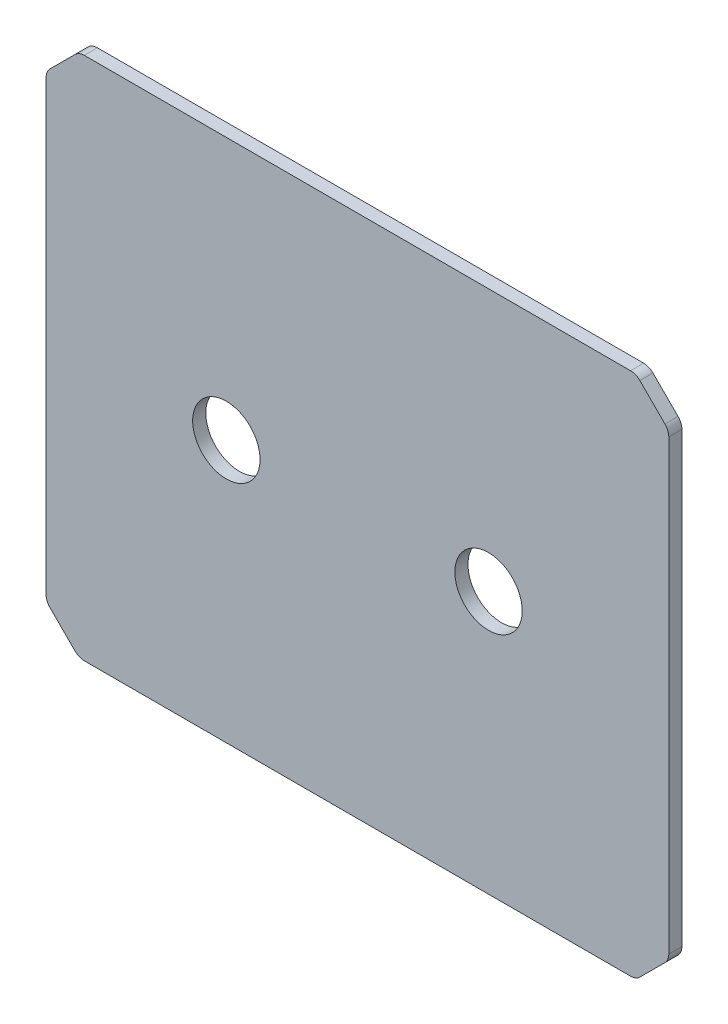
ISO-10303-21;
HEADER;
FILE_DESCRIPTION(('STEP AP214'),'2;1');
FILE_NAME('part.step','',(''),(''),'','','');
FILE_SCHEMA(('AUTOMOTIVE_DESIGN { 1 0 10303 214 1 1 1 1 }'));
ENDSEC;
DATA;
#1=APPLICATION_CONTEXT('core data for automotive mechanical design processes');
#2=APPLICATION_PROTOCOL_DEFINITION('international standard','automotive_design',2000,#1);
#3=PRODUCT_CONTEXT('',#1,'mechanical');
#4=PRODUCT('Part','Part','',(#3));
#5=PRODUCT_RELATED_PRODUCT_CATEGORY('part','',(#4));
#6=PRODUCT_DEFINITION_FORMATION('','',#4);
#7=PRODUCT_DEFINITION_CONTEXT('part definition',#1,'design');
#8=PRODUCT_DEFINITION('design','',#6,#7);
#9=PRODUCT_DEFINITION_SHAPE('','',#8);
#10=(LENGTH_UNIT() NAMED_UNIT(*) SI_UNIT(.MILLI.,.METRE.));
#11=(NAMED_UNIT(*) PLANE_ANGLE_UNIT() SI_UNIT($,.RADIAN.));
#12=(NAMED_UNIT(*) SI_UNIT($,.STERADIAN.) SOLID_ANGLE_UNIT());
#13=UNCERTAINTY_MEASURE_WITH_UNIT(LENGTH_MEASURE(1.E-05),#10,'distance_accuracy_value','');
#14=(GEOMETRIC_REPRESENTATION_CONTEXT(3) GLOBAL_UNCERTAINTY_ASSIGNED_CONTEXT((#13)) GLOBAL_UNIT_ASSIGNED_CONTEXT((#10,
#11,#12)) REPRESENTATION_CONTEXT('',''));
#15=CARTESIAN_POINT('',(0.,0.,0.));
#16=DIRECTION('',(0.,0.,1.));
#17=DIRECTION('',(1.,0.,0.));
#18=AXIS2_PLACEMENT_3D('',#15,#16,#17);
#19=CARTESIAN_POINT('',(0.,-36.0842783415865,1.27));
#20=DIRECTION('',(-1.,0.,0.));
#21=DIRECTION('',(0.,0.,1.));
#22=AXIS2_PLACEMENT_3D('',#19,#20,#21);
#23=PLANE('',#22);
#24=DIRECTION('',(0.,1.,0.));
#25=VECTOR('',#24,1.);
#26=CARTESIAN_POINT('',(0.,-36.0842783415865,1.27));
#27=LINE('',#26,#25);
#28=CARTESIAN_POINT('',(0.,3.70105122421385,1.27));
#29=VERTEX_POINT('',#28);
#30=CARTESIAN_POINT('',(0.,47.0989487757862,1.27));
#31=VERTEX_POINT('',#30);
#32=EDGE_CURVE('E304',#29,#31,#27,.T.);
#33=ORIENTED_EDGE('',*,*,#32,.T.);
#34=DIRECTION('',(0.,0.,1.));
#35=VECTOR('',#34,1.);
#36=CARTESIAN_POINT('',(0.,47.0989487757862,1.27));
#37=LINE('',#36,#35);
#38=CARTESIAN_POINT('',(0.,47.0989487757862,0.));
#39=VERTEX_POINT('',#38);
#40=EDGE_CURVE('E200',#31,#39,#37,.F.);
#41=ORIENTED_EDGE('',*,*,#40,.T.);
#42=DIRECTION('',(0.,1.,0.));
#43=VECTOR('',#42,1.);
#44=CARTESIAN_POINT('',(0.,-36.0842783415865,0.));
#45=LINE('',#44,#43);
#46=CARTESIAN_POINT('',(0.,3.70105122421385,0.));
#47=VERTEX_POINT('',#46);
#48=EDGE_CURVE('E193',#47,#39,#45,.T.);
#49=ORIENTED_EDGE('',*,*,#48,.F.);
#50=DIRECTION('',(0.,0.,1.));
#51=VECTOR('',#50,1.);
#52=CARTESIAN_POINT('',(0.,3.70105122421385,1.27));
#53=LINE('',#52,#51);
#54=EDGE_CURVE('E206',#47,#29,#53,.T.);
#55=ORIENTED_EDGE('',*,*,#54,.T.);
#56=EDGE_LOOP('',(#33,#41,#49,#55));
#57=FACE_BOUND('',#56,.T.);
#58=ADVANCED_FACE('F74',(#57),#23,.T.);
#59=CARTESIAN_POINT('',(30.1625,-36.0842783415865,0.));
#60=DIRECTION('',(0.,0.,1.));
#61=DIRECTION('',(1.,0.,0.));
#62=AXIS2_PLACEMENT_3D('',#59,#60,#61);
#63=PLANE('',#62);
#64=CARTESIAN_POINT('',(17.4625,25.4,0.));
#65=DIRECTION('',(0.,0.,1.));
#66=DIRECTION('',(1.,0.,0.));
#67=AXIS2_PLACEMENT_3D('',#64,#65,#66);
#68=CIRCLE('',#67,3.2639);
#69=CARTESIAN_POINT('',(20.7264,25.4,0.));
#70=VERTEX_POINT('',#69);
#71=EDGE_CURVE('E373',#70,#70,#68,.T.);
#72=ORIENTED_EDGE('',*,*,#71,.T.);
#73=EDGE_LOOP('',(#72));
#74=FACE_BOUND('',#73,.T.);
#75=CARTESIAN_POINT('',(42.8625,25.4,0.));
#76=DIRECTION('',(0.,0.,1.));
#77=DIRECTION('',(1.,0.,0.));
#78=AXIS2_PLACEMENT_3D('',#75,#76,#77);
#79=CIRCLE('',#78,3.26389999999998);
#80=CARTESIAN_POINT('',(46.1264,25.4,0.));
#81=VERTEX_POINT('',#80);
#82=EDGE_CURVE('E296',#81,#81,#79,.T.);
#83=ORIENTED_EDGE('',*,*,#82,.T.);
#84=EDGE_LOOP('',(#83));
#85=FACE_BOUND('',#84,.T.);
#86=ORIENTED_EDGE('',*,*,#48,.T.);
#87=CARTESIAN_POINT('',(1.27,47.0989487757862,0.));
#88=DIRECTION('',(0.,0.,1.));
#89=DIRECTION('',(1.,0.,0.));
#90=AXIS2_PLACEMENT_3D('',#87,#88,#89);
#91=CIRCLE('',#90,1.27);
#92=CARTESIAN_POINT('',(0.371974387893085,47.9969743878931,0.));
#93=VERTEX_POINT('',#92);
#94=EDGE_CURVE('E232',#39,#93,#91,.F.);
#95=ORIENTED_EDGE('',*,*,#94,.T.);
#96=DIRECTION('',(-0.70710678118655,-0.707106781186545,0.));
#97=VECTOR('',#96,1.);
#98=CARTESIAN_POINT('',(0.,47.625,0.));
#99=LINE('',#98,#97);
#100=CARTESIAN_POINT('',(2.80302561210693,50.4280256121069,0.));
#101=VERTEX_POINT('',#100);
#102=EDGE_CURVE('E314',#93,#101,#99,.F.);
#103=ORIENTED_EDGE('',*,*,#102,.T.);
#104=CARTESIAN_POINT('',(3.70105122421385,49.53,0.));
#105=DIRECTION('',(0.,0.,1.));
#106=DIRECTION('',(1.,0.,0.));
#107=AXIS2_PLACEMENT_3D('',#104,#105,#106);
#108=CIRCLE('',#107,1.27);
#109=CARTESIAN_POINT('',(3.70105122421385,50.8,0.));
#110=VERTEX_POINT('',#109);
#111=EDGE_CURVE('E230',#101,#110,#108,.F.);
#112=ORIENTED_EDGE('',*,*,#111,.T.);
#113=DIRECTION('',(1.,0.,0.));
#114=VECTOR('',#113,1.);
#115=CARTESIAN_POINT('',(30.1625,50.8,0.));
#116=LINE('',#115,#114);
#117=CARTESIAN_POINT('',(56.6239487757861,50.8,0.));
#118=VERTEX_POINT('',#117);
#119=EDGE_CURVE('E210',#110,#118,#116,.T.);
#120=ORIENTED_EDGE('',*,*,#119,.T.);
#121=CARTESIAN_POINT('',(56.6239487757861,49.53,0.));
#122=DIRECTION('',(0.,0.,1.));
#123=DIRECTION('',(1.,0.,0.));
#124=AXIS2_PLACEMENT_3D('',#121,#122,#123);
#125=CIRCLE('',#124,1.27);
#126=CARTESIAN_POINT('',(57.5219743878931,50.4280256121069,0.));
#127=VERTEX_POINT('',#126);
#128=EDGE_CURVE('E228',#118,#127,#125,.F.);
#129=ORIENTED_EDGE('',*,*,#128,.T.);
#130=DIRECTION('',(0.707106781186548,-0.707106781186548,0.));
#131=VECTOR('',#130,1.);
#132=CARTESIAN_POINT('',(57.15,50.8,0.));
#133=LINE('',#132,#131);
#134=CARTESIAN_POINT('',(59.9530256121069,47.9969743878931,0.));
#135=VERTEX_POINT('',#134);
#136=EDGE_CURVE('E311',#127,#135,#133,.T.);
#137=ORIENTED_EDGE('',*,*,#136,.T.);
#138=CARTESIAN_POINT('',(59.055,47.0989487757862,0.));
#139=DIRECTION('',(0.,0.,1.));
#140=DIRECTION('',(1.,0.,0.));
#141=AXIS2_PLACEMENT_3D('',#138,#139,#140);
#142=CIRCLE('',#141,1.27);
#143=CARTESIAN_POINT('',(60.325,47.0989487757862,0.));
#144=VERTEX_POINT('',#143);
#145=EDGE_CURVE('E226',#135,#144,#142,.F.);
#146=ORIENTED_EDGE('',*,*,#145,.T.);
#147=DIRECTION('',(0.,1.,0.));
#148=VECTOR('',#147,1.);
#149=CARTESIAN_POINT('',(60.325,-36.0842783415865,0.));
#150=LINE('',#149,#148);
#151=CARTESIAN_POINT('',(60.325,3.70105122421383,0.));
#152=VERTEX_POINT('',#151);
#153=EDGE_CURVE('E295',#152,#144,#150,.T.);
#154=ORIENTED_EDGE('',*,*,#153,.F.);
#155=CARTESIAN_POINT('',(59.055,3.70105122421383,0.));
#156=DIRECTION('',(0.,0.,1.));
#157=DIRECTION('',(1.,0.,0.));
#158=AXIS2_PLACEMENT_3D('',#155,#156,#157);
#159=CIRCLE('',#158,1.27);
#160=CARTESIAN_POINT('',(59.9530256121069,2.80302561210691,0.));
#161=VERTEX_POINT('',#160);
#162=EDGE_CURVE('E224',#152,#161,#159,.F.);
#163=ORIENTED_EDGE('',*,*,#162,.T.);
#164=DIRECTION('',(0.707106781186551,0.707106781186544,0.));
#165=VECTOR('',#164,1.);
#166=CARTESIAN_POINT('',(60.325,3.175,0.));
#167=LINE('',#166,#165);
#168=CARTESIAN_POINT('',(57.5219743878931,0.371974387893079,0.));
#169=VERTEX_POINT('',#168);
#170=EDGE_CURVE('E309',#161,#169,#167,.F.);
#171=ORIENTED_EDGE('',*,*,#170,.T.);
#172=CARTESIAN_POINT('',(56.6239487757862,1.27,0.));
#173=DIRECTION('',(0.,0.,1.));
#174=DIRECTION('',(1.,0.,0.));
#175=AXIS2_PLACEMENT_3D('',#172,#173,#174);
#176=CIRCLE('',#175,1.27);
#177=CARTESIAN_POINT('',(56.6239487757862,0.,0.));
#178=VERTEX_POINT('',#177);
#179=EDGE_CURVE('E222',#169,#178,#176,.F.);
#180=ORIENTED_EDGE('',*,*,#179,.T.);
#181=DIRECTION('',(1.,0.,0.));
#182=VECTOR('',#181,1.);
#183=CARTESIAN_POINT('',(30.1625,0.,0.));
#184=LINE('',#183,#182);
#185=CARTESIAN_POINT('',(3.70105122421383,0.,0.));
#186=VERTEX_POINT('',#185);
#187=EDGE_CURVE('E291',#186,#178,#184,.T.);
#188=ORIENTED_EDGE('',*,*,#187,.F.);
#189=CARTESIAN_POINT('',(3.70105122421383,1.27,0.));
#190=DIRECTION('',(0.,0.,1.));
#191=DIRECTION('',(1.,0.,0.));
#192=AXIS2_PLACEMENT_3D('',#189,#190,#191);
#193=CIRCLE('',#192,1.27);
#194=CARTESIAN_POINT('',(2.80302561210691,0.371974387893089,0.));
#195=VERTEX_POINT('',#194);
#196=EDGE_CURVE('E199',#186,#195,#193,.F.);
#197=ORIENTED_EDGE('',*,*,#196,.T.);
#198=DIRECTION('',(-0.707106781186545,0.70710678118655,0.));
#199=VECTOR('',#198,1.);
#200=CARTESIAN_POINT('',(3.175,0.,0.));
#201=LINE('',#200,#199);
#202=CARTESIAN_POINT('',(0.371974387893082,2.80302561210693,0.));
#203=VERTEX_POINT('',#202);
#204=EDGE_CURVE('E195',#195,#203,#201,.T.);
#205=ORIENTED_EDGE('',*,*,#204,.T.);
#206=CARTESIAN_POINT('',(1.27,3.70105122421385,0.));
#207=DIRECTION('',(0.,0.,1.));
#208=DIRECTION('',(1.,0.,0.));
#209=AXIS2_PLACEMENT_3D('',#206,#207,#208);
#210=CIRCLE('',#209,1.27);
#211=EDGE_CURVE('E190',#203,#47,#210,.F.);
#212=ORIENTED_EDGE('',*,*,#211,.T.);
#213=EDGE_LOOP('',(#86,#95,#103,#112,#120,#129,#137,#146,#154,#163,#171,#180,#188,#197,#205,#212));
#214=FACE_BOUND('',#213,.T.);
#215=ADVANCED_FACE('F192',(#74,#85,#214),#63,.F.);
#216=CARTESIAN_POINT('',(30.1625,50.8,1.27));
#217=DIRECTION('',(0.,1.,0.));
#218=DIRECTION('',(0.,0.,1.));
#219=AXIS2_PLACEMENT_3D('',#216,#217,#218);
#220=PLANE('',#219);
#221=ORIENTED_EDGE('',*,*,#119,.F.);
#222=DIRECTION('',(0.,0.,-1.));
#223=VECTOR('',#222,1.);
#224=CARTESIAN_POINT('',(3.70105122421385,50.8,1.27));
#225=LINE('',#224,#223);
#226=CARTESIAN_POINT('',(3.70105122421385,50.8,1.27));
#227=VERTEX_POINT('',#226);
#228=EDGE_CURVE('E254',#110,#227,#225,.F.);
#229=ORIENTED_EDGE('',*,*,#228,.T.);
#230=DIRECTION('',(1.,0.,0.));
#231=VECTOR('',#230,1.);
#232=CARTESIAN_POINT('',(30.1625,50.8,1.27));
#233=LINE('',#232,#231);
#234=CARTESIAN_POINT('',(56.6239487757861,50.8,1.27));
#235=VERTEX_POINT('',#234);
#236=EDGE_CURVE('E336',#227,#235,#233,.T.);
#237=ORIENTED_EDGE('',*,*,#236,.T.);
#238=DIRECTION('',(0.,0.,-1.));
#239=VECTOR('',#238,1.);
#240=CARTESIAN_POINT('',(56.6239487757861,50.8,1.27));
#241=LINE('',#240,#239);
#242=EDGE_CURVE('E251',#235,#118,#241,.T.);
#243=ORIENTED_EDGE('',*,*,#242,.T.);
#244=EDGE_LOOP('',(#221,#229,#237,#243));
#245=FACE_BOUND('',#244,.T.);
#246=ADVANCED_FACE('F334',(#245),#220,.T.);
#247=CARTESIAN_POINT('',(60.325,-36.0842783415865,1.27));
#248=DIRECTION('',(-1.,0.,0.));
#249=DIRECTION('',(0.,-1.,0.));
#250=AXIS2_PLACEMENT_3D('',#247,#248,#249);
#251=PLANE('',#250);
#252=ORIENTED_EDGE('',*,*,#153,.T.);
#253=DIRECTION('',(0.,0.,1.));
#254=VECTOR('',#253,1.);
#255=CARTESIAN_POINT('',(60.325,47.0989487757862,1.27));
#256=LINE('',#255,#254);
#257=CARTESIAN_POINT('',(60.325,47.0989487757862,1.27));
#258=VERTEX_POINT('',#257);
#259=EDGE_CURVE('E263',#144,#258,#256,.T.);
#260=ORIENTED_EDGE('',*,*,#259,.T.);
#261=DIRECTION('',(0.,1.,0.));
#262=VECTOR('',#261,1.);
#263=CARTESIAN_POINT('',(60.325,-36.0842783415865,1.27));
#264=LINE('',#263,#262);
#265=CARTESIAN_POINT('',(60.325,3.70105122421383,1.27));
#266=VERTEX_POINT('',#265);
#267=EDGE_CURVE('E355',#266,#258,#264,.T.);
#268=ORIENTED_EDGE('',*,*,#267,.F.);
#269=DIRECTION('',(0.,0.,1.));
#270=VECTOR('',#269,1.);
#271=CARTESIAN_POINT('',(60.325,3.70105122421383,0.));
#272=LINE('',#271,#270);
#273=EDGE_CURVE('E260',#266,#152,#272,.F.);
#274=ORIENTED_EDGE('',*,*,#273,.T.);
#275=EDGE_LOOP('',(#252,#260,#268,#274));
#276=FACE_BOUND('',#275,.T.);
#277=ADVANCED_FACE('F351',(#276),#251,.F.);
#278=CARTESIAN_POINT('',(30.1625,0.,1.27));
#279=DIRECTION('',(0.,1.,0.));
#280=DIRECTION('',(0.,0.,1.));
#281=AXIS2_PLACEMENT_3D('',#278,#279,#280);
#282=PLANE('',#281);
#283=ORIENTED_EDGE('',*,*,#187,.T.);
#284=DIRECTION('',(0.,0.,-1.));
#285=VECTOR('',#284,1.);
#286=CARTESIAN_POINT('',(56.6239487757862,0.,1.27));
#287=LINE('',#286,#285);
#288=CARTESIAN_POINT('',(56.6239487757862,0.,1.27));
#289=VERTEX_POINT('',#288);
#290=EDGE_CURVE('E273',#178,#289,#287,.F.);
#291=ORIENTED_EDGE('',*,*,#290,.T.);
#292=DIRECTION('',(1.,0.,0.));
#293=VECTOR('',#292,1.);
#294=CARTESIAN_POINT('',(30.1625,0.,1.27));
#295=LINE('',#294,#293);
#296=CARTESIAN_POINT('',(3.70105122421383,0.,1.27));
#297=VERTEX_POINT('',#296);
#298=EDGE_CURVE('E209',#297,#289,#295,.T.);
#299=ORIENTED_EDGE('',*,*,#298,.F.);
#300=DIRECTION('',(0.,0.,-1.));
#301=VECTOR('',#300,1.);
#302=CARTESIAN_POINT('',(3.70105122421383,0.,0.));
#303=LINE('',#302,#301);
#304=EDGE_CURVE('E270',#297,#186,#303,.T.);
#305=ORIENTED_EDGE('',*,*,#304,.T.);
#306=EDGE_LOOP('',(#283,#291,#299,#305));
#307=FACE_BOUND('',#306,.T.);
#308=ADVANCED_FACE('F290',(#307),#282,.F.);
#309=CARTESIAN_POINT('',(30.1625,-36.0842783415865,1.27));
#310=DIRECTION('',(0.,0.,1.));
#311=DIRECTION('',(1.,0.,0.));
#312=AXIS2_PLACEMENT_3D('',#309,#310,#311);
#313=PLANE('',#312);
#314=CARTESIAN_POINT('',(17.4625,25.4,1.27));
#315=DIRECTION('',(0.,0.,1.));
#316=DIRECTION('',(1.,0.,0.));
#317=AXIS2_PLACEMENT_3D('',#314,#315,#316);
#318=CIRCLE('',#317,3.2639);
#319=CARTESIAN_POINT('',(20.7264,25.4,1.27));
#320=VERTEX_POINT('',#319);
#321=EDGE_CURVE('E371',#320,#320,#318,.T.);
#322=ORIENTED_EDGE('',*,*,#321,.F.);
#323=EDGE_LOOP('',(#322));
#324=FACE_BOUND('',#323,.T.);
#325=CARTESIAN_POINT('',(42.8625,25.4,1.27));
#326=DIRECTION('',(0.,0.,1.));
#327=DIRECTION('',(1.,0.,0.));
#328=AXIS2_PLACEMENT_3D('',#325,#326,#327);
#329=CIRCLE('',#328,3.26389999999998);
#330=CARTESIAN_POINT('',(46.1264,25.4,1.27));
#331=VERTEX_POINT('',#330);
#332=EDGE_CURVE('E301',#331,#331,#329,.T.);
#333=ORIENTED_EDGE('',*,*,#332,.F.);
#334=EDGE_LOOP('',(#333));
#335=FACE_BOUND('',#334,.T.);
#336=DIRECTION('',(0.70710678118655,0.707106781186545,0.));
#337=VECTOR('',#336,1.);
#338=CARTESIAN_POINT('',(-26.7733891707931,20.8516108292071,1.27));
#339=LINE('',#338,#337);
#340=CARTESIAN_POINT('',(2.80302561210693,50.4280256121069,1.27));
#341=VERTEX_POINT('',#340);
#342=CARTESIAN_POINT('',(0.371974387893083,47.9969743878931,1.27));
#343=VERTEX_POINT('',#342);
#344=EDGE_CURVE('E217',#341,#343,#339,.F.);
#345=ORIENTED_EDGE('',*,*,#344,.T.);
#346=CARTESIAN_POINT('',(1.27,47.0989487757862,1.27));
#347=DIRECTION('',(0.,0.,1.));
#348=DIRECTION('',(1.,0.,0.));
#349=AXIS2_PLACEMENT_3D('',#346,#347,#348);
#350=CIRCLE('',#349,1.27);
#351=EDGE_CURVE('E249',#343,#31,#350,.T.);
#352=ORIENTED_EDGE('',*,*,#351,.T.);
#353=ORIENTED_EDGE('',*,*,#32,.F.);
#354=CARTESIAN_POINT('',(1.27,3.70105122421385,1.27));
#355=DIRECTION('',(0.,0.,1.));
#356=DIRECTION('',(1.,0.,0.));
#357=AXIS2_PLACEMENT_3D('',#354,#355,#356);
#358=CIRCLE('',#357,1.27);
#359=CARTESIAN_POINT('',(0.371974387893076,2.80302561210694,1.27));
#360=VERTEX_POINT('',#359);
#361=EDGE_CURVE('E212',#29,#360,#358,.T.);
#362=ORIENTED_EDGE('',*,*,#361,.T.);
#363=DIRECTION('',(0.707106781186545,-0.70710678118655,0.));
#364=VECTOR('',#363,1.);
#365=CARTESIAN_POINT('',(34.7108891707931,-31.5358891707934,1.27));
#366=LINE('',#365,#364);
#367=CARTESIAN_POINT('',(2.80302561210691,0.37197438789309,1.27));
#368=VERTEX_POINT('',#367);
#369=EDGE_CURVE('E213',#360,#368,#366,.T.);
#370=ORIENTED_EDGE('',*,*,#369,.T.);
#371=CARTESIAN_POINT('',(3.70105122421383,1.27,1.27));
#372=DIRECTION('',(0.,0.,1.));
#373=DIRECTION('',(1.,0.,0.));
#374=AXIS2_PLACEMENT_3D('',#371,#372,#373);
#375=CIRCLE('',#374,1.27);
#376=EDGE_CURVE('E239',#368,#297,#375,.T.);
#377=ORIENTED_EDGE('',*,*,#376,.T.);
#378=ORIENTED_EDGE('',*,*,#298,.T.);
#379=CARTESIAN_POINT('',(56.6239487757862,1.27,1.27));
#380=DIRECTION('',(0.,0.,1.));
#381=DIRECTION('',(1.,0.,0.));
#382=AXIS2_PLACEMENT_3D('',#379,#380,#381);
#383=CIRCLE('',#382,1.27);
#384=CARTESIAN_POINT('',(57.5219743878931,0.371974387893083,1.27));
#385=VERTEX_POINT('',#384);
#386=EDGE_CURVE('E241',#289,#385,#383,.T.);
#387=ORIENTED_EDGE('',*,*,#386,.T.);
#388=DIRECTION('',(-0.707106781186551,-0.707106781186544,0.));
#389=VECTOR('',#388,1.);
#390=CARTESIAN_POINT('',(25.6141108292066,-31.5358891707931,1.27));
#391=LINE('',#390,#389);
#392=CARTESIAN_POINT('',(59.9530256121069,2.80302561210691,1.27));
#393=VERTEX_POINT('',#392);
#394=EDGE_CURVE('E318',#385,#393,#391,.F.);
#395=ORIENTED_EDGE('',*,*,#394,.T.);
#396=CARTESIAN_POINT('',(59.055,3.70105122421383,1.27));
#397=DIRECTION('',(0.,0.,1.));
#398=DIRECTION('',(1.,0.,0.));
#399=AXIS2_PLACEMENT_3D('',#396,#397,#398);
#400=CIRCLE('',#399,1.27);
#401=EDGE_CURVE('E243',#393,#266,#400,.T.);
#402=ORIENTED_EDGE('',*,*,#401,.T.);
#403=ORIENTED_EDGE('',*,*,#267,.T.);
#404=CARTESIAN_POINT('',(59.055,47.0989487757862,1.27));
#405=DIRECTION('',(0.,0.,1.));
#406=DIRECTION('',(1.,0.,0.));
#407=AXIS2_PLACEMENT_3D('',#404,#405,#406);
#408=CIRCLE('',#407,1.27);
#409=CARTESIAN_POINT('',(59.9530256121069,47.9969743878931,1.27));
#410=VERTEX_POINT('',#409);
#411=EDGE_CURVE('E245',#258,#410,#408,.T.);
#412=ORIENTED_EDGE('',*,*,#411,.T.);
#413=DIRECTION('',(-0.707106781186548,0.707106781186548,0.));
#414=VECTOR('',#413,1.);
#415=CARTESIAN_POINT('',(87.0983891707932,20.8516108292067,1.27));
#416=LINE('',#415,#414);
#417=CARTESIAN_POINT('',(57.521974387893,50.4280256121069,1.27));
#418=VERTEX_POINT('',#417);
#419=EDGE_CURVE('E321',#410,#418,#416,.T.);
#420=ORIENTED_EDGE('',*,*,#419,.T.);
#421=CARTESIAN_POINT('',(56.6239487757861,49.53,1.27));
#422=DIRECTION('',(0.,0.,1.));
#423=DIRECTION('',(1.,0.,0.));
#424=AXIS2_PLACEMENT_3D('',#421,#422,#423);
#425=CIRCLE('',#424,1.27);
#426=EDGE_CURVE('E89',#418,#235,#425,.T.);
#427=ORIENTED_EDGE('',*,*,#426,.T.);
#428=ORIENTED_EDGE('',*,*,#236,.F.);
#429=CARTESIAN_POINT('',(3.70105122421385,49.53,1.27));
#430=DIRECTION('',(0.,0.,1.));
#431=DIRECTION('',(1.,0.,0.));
#432=AXIS2_PLACEMENT_3D('',#429,#430,#431);
#433=CIRCLE('',#432,1.27);
#434=EDGE_CURVE('E97',#227,#341,#433,.T.);
#435=ORIENTED_EDGE('',*,*,#434,.T.);
#436=EDGE_LOOP('',(#345,#352,#353,#362,#370,#377,#378,#387,#395,#402,#403,#412,#420,#427,#428,#435));
#437=FACE_BOUND('',#436,.T.);
#438=ADVANCED_FACE('F281',(#324,#335,#437),#313,.T.);
#439=CARTESIAN_POINT('',(42.8625,25.4,0.));
#440=DIRECTION('',(0.,0.,1.));
#441=DIRECTION('',(1.,0.,0.));
#442=AXIS2_PLACEMENT_3D('',#439,#440,#441);
#443=CYLINDRICAL_SURFACE('',#442,3.26389999999998);
#444=ORIENTED_EDGE('',*,*,#82,.F.);
#445=EDGE_LOOP('',(#444));
#446=FACE_BOUND('',#445,.T.);
#447=ORIENTED_EDGE('',*,*,#332,.T.);
#448=EDGE_LOOP('',(#447));
#449=FACE_BOUND('',#448,.T.);
#450=ADVANCED_FACE('F383',(#446,#449),#443,.F.);
#451=CARTESIAN_POINT('',(17.4625,25.4,0.));
#452=DIRECTION('',(0.,0.,1.));
#453=DIRECTION('',(1.,0.,0.));
#454=AXIS2_PLACEMENT_3D('',#451,#452,#453);
#455=CYLINDRICAL_SURFACE('',#454,3.2639);
#456=ORIENTED_EDGE('',*,*,#71,.F.);
#457=EDGE_LOOP('',(#456));
#458=FACE_BOUND('',#457,.T.);
#459=ORIENTED_EDGE('',*,*,#321,.T.);
#460=EDGE_LOOP('',(#459));
#461=FACE_BOUND('',#460,.T.);
#462=ADVANCED_FACE('F379',(#458,#461),#455,.F.);
#463=CARTESIAN_POINT('',(3.175,0.,1.27));
#464=DIRECTION('',(-0.70710678118655,-0.707106781186545,0.));
#465=DIRECTION('',(0.707106781186545,-0.70710678118655,0.));
#466=AXIS2_PLACEMENT_3D('',#463,#464,#465);
#467=PLANE('',#466);
#468=ORIENTED_EDGE('',*,*,#204,.F.);
#469=DIRECTION('',(0.,0.,-1.));
#470=VECTOR('',#469,1.);
#471=CARTESIAN_POINT('',(2.80302561210691,0.371974387893089,1.27));
#472=LINE('',#471,#470);
#473=EDGE_CURVE('E12',#195,#368,#472,.F.);
#474=ORIENTED_EDGE('',*,*,#473,.T.);
#475=ORIENTED_EDGE('',*,*,#369,.F.);
#476=DIRECTION('',(0.,0.,1.));
#477=VECTOR('',#476,1.);
#478=CARTESIAN_POINT('',(0.371974387893082,2.80302561210693,1.27));
#479=LINE('',#478,#477);
#480=EDGE_CURVE('E82',#360,#203,#479,.F.);
#481=ORIENTED_EDGE('',*,*,#480,.T.);
#482=EDGE_LOOP('',(#468,#474,#475,#481));
#483=FACE_BOUND('',#482,.T.);
#484=ADVANCED_FACE('F277',(#483),#467,.T.);
#485=CARTESIAN_POINT('',(0.,47.625,1.27));
#486=DIRECTION('',(0.707106781186545,-0.70710678118655,0.));
#487=DIRECTION('',(0.70710678118655,0.707106781186545,0.));
#488=AXIS2_PLACEMENT_3D('',#485,#486,#487);
#489=PLANE('',#488);
#490=ORIENTED_EDGE('',*,*,#102,.F.);
#491=DIRECTION('',(0.,0.,-1.));
#492=VECTOR('',#491,1.);
#493=CARTESIAN_POINT('',(0.371974387893084,47.9969743878931,1.27));
#494=LINE('',#493,#492);
#495=EDGE_CURVE('E236',#93,#343,#494,.F.);
#496=ORIENTED_EDGE('',*,*,#495,.T.);
#497=ORIENTED_EDGE('',*,*,#344,.F.);
#498=DIRECTION('',(0.,0.,1.));
#499=VECTOR('',#498,1.);
#500=CARTESIAN_POINT('',(2.80302561210693,50.4280256121069,1.27));
#501=LINE('',#500,#499);
#502=EDGE_CURVE('E234',#341,#101,#501,.F.);
#503=ORIENTED_EDGE('',*,*,#502,.T.);
#504=EDGE_LOOP('',(#490,#496,#497,#503));
#505=FACE_BOUND('',#504,.T.);
#506=ADVANCED_FACE('F330',(#505),#489,.F.);
#507=CARTESIAN_POINT('',(57.15,50.8,1.27));
#508=DIRECTION('',(0.707106781186548,0.707106781186548,0.));
#509=DIRECTION('',(-0.707106781186548,0.707106781186548,0.));
#510=AXIS2_PLACEMENT_3D('',#507,#508,#509);
#511=PLANE('',#510);
#512=ORIENTED_EDGE('',*,*,#136,.F.);
#513=DIRECTION('',(0.,0.,-1.));
#514=VECTOR('',#513,1.);
#515=CARTESIAN_POINT('',(57.5219743878931,50.4280256121069,1.27));
#516=LINE('',#515,#514);
#517=EDGE_CURVE('E258',#127,#418,#516,.F.);
#518=ORIENTED_EDGE('',*,*,#517,.T.);
#519=ORIENTED_EDGE('',*,*,#419,.F.);
#520=DIRECTION('',(0.,0.,1.));
#521=VECTOR('',#520,1.);
#522=CARTESIAN_POINT('',(59.9530256121069,47.9969743878931,0.));
#523=LINE('',#522,#521);
#524=EDGE_CURVE('E256',#410,#135,#523,.F.);
#525=ORIENTED_EDGE('',*,*,#524,.T.);
#526=EDGE_LOOP('',(#512,#518,#519,#525));
#527=FACE_BOUND('',#526,.T.);
#528=ADVANCED_FACE('F343',(#527),#511,.T.);
#529=CARTESIAN_POINT('',(60.325,3.175,1.27));
#530=DIRECTION('',(-0.707106781186544,0.707106781186551,0.));
#531=DIRECTION('',(-0.707106781186551,-0.707106781186544,0.));
#532=AXIS2_PLACEMENT_3D('',#529,#530,#531);
#533=PLANE('',#532);
#534=ORIENTED_EDGE('',*,*,#170,.F.);
#535=DIRECTION('',(0.,0.,-1.));
#536=VECTOR('',#535,1.);
#537=CARTESIAN_POINT('',(59.9530256121069,2.80302561210691,1.27));
#538=LINE('',#537,#536);
#539=EDGE_CURVE('E268',#161,#393,#538,.F.);
#540=ORIENTED_EDGE('',*,*,#539,.T.);
#541=ORIENTED_EDGE('',*,*,#394,.F.);
#542=DIRECTION('',(0.,0.,1.));
#543=VECTOR('',#542,1.);
#544=CARTESIAN_POINT('',(57.5219743878931,0.37197438789308,0.));
#545=LINE('',#544,#543);
#546=EDGE_CURVE('E266',#385,#169,#545,.F.);
#547=ORIENTED_EDGE('',*,*,#546,.T.);
#548=EDGE_LOOP('',(#534,#540,#541,#547));
#549=FACE_BOUND('',#548,.T.);
#550=ADVANCED_FACE('F362',(#549),#533,.F.);
#551=CARTESIAN_POINT('',(1.27,47.0989487757862,1.27));
#552=DIRECTION('',(0.,0.,1.));
#553=DIRECTION('',(1.,0.,0.));
#554=AXIS2_PLACEMENT_3D('',#551,#552,#553);
#555=CYLINDRICAL_SURFACE('',#554,1.27);
#556=ORIENTED_EDGE('',*,*,#351,.F.);
#557=ORIENTED_EDGE('',*,*,#495,.F.);
#558=ORIENTED_EDGE('',*,*,#94,.F.);
#559=ORIENTED_EDGE('',*,*,#40,.F.);
#560=EDGE_LOOP('',(#556,#557,#558,#559));
#561=FACE_BOUND('',#560,.T.);
#562=ADVANCED_FACE('F327',(#561),#555,.T.);
#563=CARTESIAN_POINT('',(3.70105122421385,49.53,1.27));
#564=DIRECTION('',(0.,0.,-1.));
#565=DIRECTION('',(-1.,0.,0.));
#566=AXIS2_PLACEMENT_3D('',#563,#564,#565);
#567=CYLINDRICAL_SURFACE('',#566,1.27);
#568=ORIENTED_EDGE('',*,*,#111,.F.);
#569=ORIENTED_EDGE('',*,*,#502,.F.);
#570=ORIENTED_EDGE('',*,*,#434,.F.);
#571=ORIENTED_EDGE('',*,*,#228,.F.);
#572=EDGE_LOOP('',(#568,#569,#570,#571));
#573=FACE_BOUND('',#572,.T.);
#574=ADVANCED_FACE('F331',(#573),#567,.T.);
#575=CARTESIAN_POINT('',(56.6239487757861,49.53,1.27));
#576=DIRECTION('',(0.,0.,-1.));
#577=DIRECTION('',(-1.,0.,0.));
#578=AXIS2_PLACEMENT_3D('',#575,#576,#577);
#579=CYLINDRICAL_SURFACE('',#578,1.27);
#580=ORIENTED_EDGE('',*,*,#426,.F.);
#581=ORIENTED_EDGE('',*,*,#517,.F.);
#582=ORIENTED_EDGE('',*,*,#128,.F.);
#583=ORIENTED_EDGE('',*,*,#242,.F.);
#584=EDGE_LOOP('',(#580,#581,#582,#583));
#585=FACE_BOUND('',#584,.T.);
#586=ADVANCED_FACE('F338',(#585),#579,.T.);
#587=CARTESIAN_POINT('',(59.055,47.0989487757862,1.27));
#588=DIRECTION('',(0.,0.,-1.));
#589=DIRECTION('',(-1.,0.,0.));
#590=AXIS2_PLACEMENT_3D('',#587,#588,#589);
#591=CYLINDRICAL_SURFACE('',#590,1.27);
#592=ORIENTED_EDGE('',*,*,#145,.F.);
#593=ORIENTED_EDGE('',*,*,#524,.F.);
#594=ORIENTED_EDGE('',*,*,#411,.F.);
#595=ORIENTED_EDGE('',*,*,#259,.F.);
#596=EDGE_LOOP('',(#592,#593,#594,#595));
#597=FACE_BOUND('',#596,.T.);
#598=ADVANCED_FACE('F347',(#597),#591,.T.);
#599=CARTESIAN_POINT('',(59.055,3.70105122421383,1.27));
#600=DIRECTION('',(0.,0.,-1.));
#601=DIRECTION('',(-1.,0.,0.));
#602=AXIS2_PLACEMENT_3D('',#599,#600,#601);
#603=CYLINDRICAL_SURFACE('',#602,1.27);
#604=ORIENTED_EDGE('',*,*,#401,.F.);
#605=ORIENTED_EDGE('',*,*,#539,.F.);
#606=ORIENTED_EDGE('',*,*,#162,.F.);
#607=ORIENTED_EDGE('',*,*,#273,.F.);
#608=EDGE_LOOP('',(#604,#605,#606,#607));
#609=FACE_BOUND('',#608,.T.);
#610=ADVANCED_FACE('F358',(#609),#603,.T.);
#611=CARTESIAN_POINT('',(56.6239487757862,1.27,1.27));
#612=DIRECTION('',(0.,0.,1.));
#613=DIRECTION('',(1.,0.,0.));
#614=AXIS2_PLACEMENT_3D('',#611,#612,#613);
#615=CYLINDRICAL_SURFACE('',#614,1.27);
#616=ORIENTED_EDGE('',*,*,#179,.F.);
#617=ORIENTED_EDGE('',*,*,#546,.F.);
#618=ORIENTED_EDGE('',*,*,#386,.F.);
#619=ORIENTED_EDGE('',*,*,#290,.F.);
#620=EDGE_LOOP('',(#616,#617,#618,#619));
#621=FACE_BOUND('',#620,.T.);
#622=ADVANCED_FACE('F366',(#621),#615,.T.);
#623=CARTESIAN_POINT('',(3.70105122421383,1.27,1.27));
#624=DIRECTION('',(0.,0.,1.));
#625=DIRECTION('',(1.,0.,0.));
#626=AXIS2_PLACEMENT_3D('',#623,#624,#625);
#627=CYLINDRICAL_SURFACE('',#626,1.27);
#628=ORIENTED_EDGE('',*,*,#376,.F.);
#629=ORIENTED_EDGE('',*,*,#473,.F.);
#630=ORIENTED_EDGE('',*,*,#196,.F.);
#631=ORIENTED_EDGE('',*,*,#304,.F.);
#632=EDGE_LOOP('',(#628,#629,#630,#631));
#633=FACE_BOUND('',#632,.T.);
#634=ADVANCED_FACE('F286',(#633),#627,.T.);
#635=CARTESIAN_POINT('',(1.27,3.70105122421385,1.27));
#636=DIRECTION('',(0.,0.,1.));
#637=DIRECTION('',(1.,0.,0.));
#638=AXIS2_PLACEMENT_3D('',#635,#636,#637);
#639=CYLINDRICAL_SURFACE('',#638,1.27);
#640=ORIENTED_EDGE('',*,*,#211,.F.);
#641=ORIENTED_EDGE('',*,*,#480,.F.);
#642=ORIENTED_EDGE('',*,*,#361,.F.);
#643=ORIENTED_EDGE('',*,*,#54,.F.);
#644=EDGE_LOOP('',(#640,#641,#642,#643));
#645=FACE_BOUND('',#644,.T.);
#646=ADVANCED_FACE('F76',(#645),#639,.T.);
#647=CLOSED_SHELL('',(#58,#215,#246,#277,#308,#438,#450,#462,#484,#506,#528,#550,#562,#574,#586,
#598,#610,#622,#634,#646));
#648=MANIFOLD_SOLID_BREP('B2',#647);
#649=ADVANCED_BREP_SHAPE_REPRESENTATION('',(#18,#648),#14);
#650=SHAPE_DEFINITION_REPRESENTATION(#9,#649);
ENDSEC;
END-ISO-10303-21;
